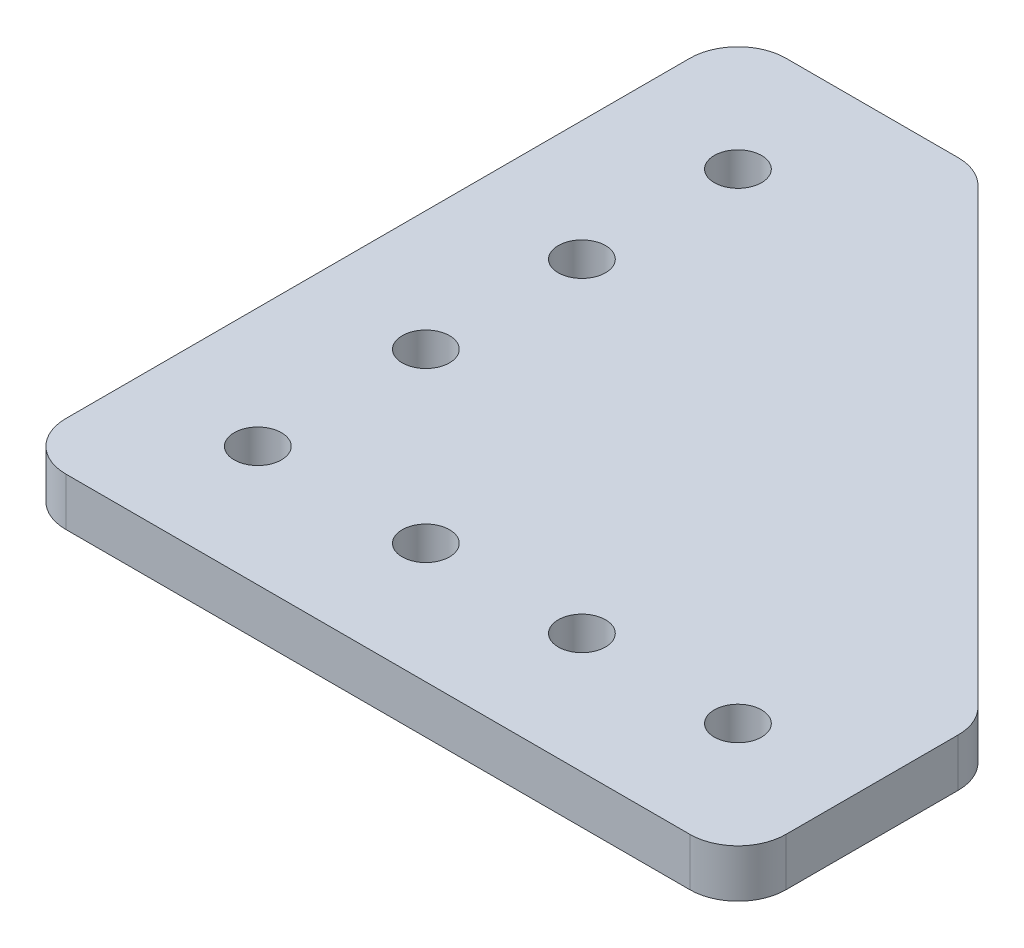
ISO-10303-21;
HEADER;
FILE_DESCRIPTION(('STEP AP214'),'2;1');
FILE_NAME('part.step','',(''),(''),'','','');
FILE_SCHEMA(('AUTOMOTIVE_DESIGN { 1 0 10303 214 1 1 1 1 }'));
ENDSEC;
DATA;
#1=APPLICATION_CONTEXT('core data for automotive mechanical design processes');
#2=APPLICATION_PROTOCOL_DEFINITION('international standard','automotive_design',2000,#1);
#3=PRODUCT_CONTEXT('',#1,'mechanical');
#4=PRODUCT('Part','Part','',(#3));
#5=PRODUCT_RELATED_PRODUCT_CATEGORY('part','',(#4));
#6=PRODUCT_DEFINITION_FORMATION('','',#4);
#7=PRODUCT_DEFINITION_CONTEXT('part definition',#1,'design');
#8=PRODUCT_DEFINITION('design','',#6,#7);
#9=PRODUCT_DEFINITION_SHAPE('','',#8);
#10=(LENGTH_UNIT() NAMED_UNIT(*) SI_UNIT(.MILLI.,.METRE.));
#11=(NAMED_UNIT(*) PLANE_ANGLE_UNIT() SI_UNIT($,.RADIAN.));
#12=(NAMED_UNIT(*) SI_UNIT($,.STERADIAN.) SOLID_ANGLE_UNIT());
#13=UNCERTAINTY_MEASURE_WITH_UNIT(LENGTH_MEASURE(1.E-05),#10,'distance_accuracy_value','');
#14=(GEOMETRIC_REPRESENTATION_CONTEXT(3) GLOBAL_UNCERTAINTY_ASSIGNED_CONTEXT((#13)) GLOBAL_UNIT_ASSIGNED_CONTEXT((#10,
#11,#12)) REPRESENTATION_CONTEXT('',''));
#15=CARTESIAN_POINT('',(0.,0.,0.));
#16=DIRECTION('',(0.,0.,1.));
#17=DIRECTION('',(1.,0.,0.));
#18=AXIS2_PLACEMENT_3D('',#15,#16,#17);
#19=CARTESIAN_POINT('',(0.,5.08,0.));
#20=DIRECTION('',(0.,-1.,0.));
#21=DIRECTION('',(0.,0.,-1.));
#22=AXIS2_PLACEMENT_3D('',#19,#20,#21);
#23=PLANE('',#22);
#24=DIRECTION('',(-0.707106781186548,0.,-0.707106781186548));
#25=VECTOR('',#24,1.);
#26=CARTESIAN_POINT('',(25.4,5.08,-76.2));
#27=LINE('',#26,#25);
#28=CARTESIAN_POINT('',(74.7121024484277,5.08,-26.8878975515723));
#29=VERTEX_POINT('',#28);
#30=CARTESIAN_POINT('',(26.8878975515723,5.08,-74.7121024484277));
#31=VERTEX_POINT('',#30);
#32=EDGE_CURVE('E208',#29,#31,#27,.T.);
#33=ORIENTED_EDGE('',*,*,#32,.T.);
#34=CARTESIAN_POINT('',(23.2957951031447,5.08,-71.12));
#35=DIRECTION('',(0.,-1.,0.));
#36=DIRECTION('',(0.,0.,-1.));
#37=AXIS2_PLACEMENT_3D('',#34,#35,#36);
#38=CIRCLE('',#37,5.08);
#39=CARTESIAN_POINT('',(23.2957951031447,5.08,-76.2));
#40=VERTEX_POINT('',#39);
#41=EDGE_CURVE('E189',#31,#40,#38,.F.);
#42=ORIENTED_EDGE('',*,*,#41,.T.);
#43=DIRECTION('',(-1.,0.,0.));
#44=VECTOR('',#43,1.);
#45=CARTESIAN_POINT('',(0.,5.08,-76.2));
#46=LINE('',#45,#44);
#47=CARTESIAN_POINT('',(5.08,5.08,-76.2));
#48=VERTEX_POINT('',#47);
#49=EDGE_CURVE('E210',#40,#48,#46,.T.);
#50=ORIENTED_EDGE('',*,*,#49,.T.);
#51=CARTESIAN_POINT('',(5.08,5.08,-71.12));
#52=DIRECTION('',(0.,-1.,0.));
#53=DIRECTION('',(0.,0.,-1.));
#54=AXIS2_PLACEMENT_3D('',#51,#52,#53);
#55=CIRCLE('',#54,5.08);
#56=CARTESIAN_POINT('',(0.,5.08,-71.12));
#57=VERTEX_POINT('',#56);
#58=EDGE_CURVE('E187',#48,#57,#55,.F.);
#59=ORIENTED_EDGE('',*,*,#58,.T.);
#60=DIRECTION('',(0.,0.,1.));
#61=VECTOR('',#60,1.);
#62=CARTESIAN_POINT('',(0.,5.08,0.));
#63=LINE('',#62,#61);
#64=CARTESIAN_POINT('',(0.,5.08,-5.08));
#65=VERTEX_POINT('',#64);
#66=EDGE_CURVE('E140',#57,#65,#63,.T.);
#67=ORIENTED_EDGE('',*,*,#66,.T.);
#68=CARTESIAN_POINT('',(5.08,5.08,-5.08));
#69=DIRECTION('',(0.,-1.,0.));
#70=DIRECTION('',(0.,0.,-1.));
#71=AXIS2_PLACEMENT_3D('',#68,#69,#70);
#72=CIRCLE('',#71,5.08);
#73=CARTESIAN_POINT('',(5.08000000000003,5.08,0.));
#74=VERTEX_POINT('',#73);
#75=EDGE_CURVE('E165',#65,#74,#72,.F.);
#76=ORIENTED_EDGE('',*,*,#75,.T.);
#77=DIRECTION('',(1.,0.,0.));
#78=VECTOR('',#77,1.);
#79=CARTESIAN_POINT('',(76.2,5.08,0.));
#80=LINE('',#79,#78);
#81=CARTESIAN_POINT('',(71.12,5.08,0.));
#82=VERTEX_POINT('',#81);
#83=EDGE_CURVE('E139',#74,#82,#80,.T.);
#84=ORIENTED_EDGE('',*,*,#83,.T.);
#85=CARTESIAN_POINT('',(71.12,5.08,-5.08));
#86=DIRECTION('',(0.,-1.,0.));
#87=DIRECTION('',(0.,0.,-1.));
#88=AXIS2_PLACEMENT_3D('',#85,#86,#87);
#89=CIRCLE('',#88,5.08);
#90=CARTESIAN_POINT('',(76.2,5.08,-5.08));
#91=VERTEX_POINT('',#90);
#92=EDGE_CURVE('E65',#82,#91,#89,.F.);
#93=ORIENTED_EDGE('',*,*,#92,.T.);
#94=DIRECTION('',(0.,0.,-1.));
#95=VECTOR('',#94,1.);
#96=CARTESIAN_POINT('',(76.2,5.08,-25.4));
#97=LINE('',#96,#95);
#98=CARTESIAN_POINT('',(76.2,5.08,-23.2957951031447));
#99=VERTEX_POINT('',#98);
#100=EDGE_CURVE('E197',#91,#99,#97,.T.);
#101=ORIENTED_EDGE('',*,*,#100,.T.);
#102=CARTESIAN_POINT('',(71.12,5.08,-23.2957951031447));
#103=DIRECTION('',(0.,-1.,0.));
#104=DIRECTION('',(0.,0.,-1.));
#105=AXIS2_PLACEMENT_3D('',#102,#103,#104);
#106=CIRCLE('',#105,5.08);
#107=EDGE_CURVE('E184',#99,#29,#106,.F.);
#108=ORIENTED_EDGE('',*,*,#107,.T.);
#109=EDGE_LOOP('',(#33,#42,#50,#59,#67,#76,#84,#93,#101,#108));
#110=FACE_BOUND('',#109,.T.);
#111=CARTESIAN_POINT('',(12.7,5.08,-63.5));
#112=DIRECTION('',(0.,1.,0.));
#113=DIRECTION('',(0.,0.,1.));
#114=AXIS2_PLACEMENT_3D('',#111,#112,#113);
#115=CIRCLE('',#114,2.5);
#116=CARTESIAN_POINT('',(12.7,5.08,-61.));
#117=VERTEX_POINT('',#116);
#118=EDGE_CURVE('E148',#117,#117,#115,.T.);
#119=ORIENTED_EDGE('',*,*,#118,.F.);
#120=EDGE_LOOP('',(#119));
#121=FACE_BOUND('',#120,.T.);
#122=CARTESIAN_POINT('',(63.5,5.08,-12.7));
#123=DIRECTION('',(0.,1.,0.));
#124=DIRECTION('',(0.,0.,1.));
#125=AXIS2_PLACEMENT_3D('',#122,#123,#124);
#126=CIRCLE('',#125,2.5);
#127=CARTESIAN_POINT('',(63.5,5.08,-10.2));
#128=VERTEX_POINT('',#127);
#129=EDGE_CURVE('E218',#128,#128,#126,.T.);
#130=ORIENTED_EDGE('',*,*,#129,.F.);
#131=EDGE_LOOP('',(#130));
#132=FACE_BOUND('',#131,.T.);
#133=CARTESIAN_POINT('',(12.7000000000002,5.08,-46.99));
#134=DIRECTION('',(0.,1.,0.));
#135=DIRECTION('',(0.,0.,1.));
#136=AXIS2_PLACEMENT_3D('',#133,#134,#135);
#137=CIRCLE('',#136,2.5);
#138=CARTESIAN_POINT('',(12.7000000000002,5.08,-44.49));
#139=VERTEX_POINT('',#138);
#140=EDGE_CURVE('E223',#139,#139,#137,.T.);
#141=ORIENTED_EDGE('',*,*,#140,.F.);
#142=EDGE_LOOP('',(#141));
#143=FACE_BOUND('',#142,.T.);
#144=CARTESIAN_POINT('',(12.7000000000005,5.08,-30.48));
#145=DIRECTION('',(0.,1.,0.));
#146=DIRECTION('',(0.,0.,1.));
#147=AXIS2_PLACEMENT_3D('',#144,#145,#146);
#148=CIRCLE('',#147,2.5);
#149=CARTESIAN_POINT('',(12.7000000000005,5.08,-27.98));
#150=VERTEX_POINT('',#149);
#151=EDGE_CURVE('E229',#150,#150,#148,.T.);
#152=ORIENTED_EDGE('',*,*,#151,.F.);
#153=EDGE_LOOP('',(#152));
#154=FACE_BOUND('',#153,.T.);
#155=CARTESIAN_POINT('',(12.7,5.08,-12.7));
#156=DIRECTION('',(0.,1.,0.));
#157=DIRECTION('',(0.,0.,1.));
#158=AXIS2_PLACEMENT_3D('',#155,#156,#157);
#159=CIRCLE('',#158,2.5);
#160=CARTESIAN_POINT('',(12.7,5.08,-10.2));
#161=VERTEX_POINT('',#160);
#162=EDGE_CURVE('E235',#161,#161,#159,.T.);
#163=ORIENTED_EDGE('',*,*,#162,.F.);
#164=EDGE_LOOP('',(#163));
#165=FACE_BOUND('',#164,.T.);
#166=CARTESIAN_POINT('',(46.99,5.08,-12.7));
#167=DIRECTION('',(0.,1.,0.));
#168=DIRECTION('',(0.,0.,1.));
#169=AXIS2_PLACEMENT_3D('',#166,#167,#168);
#170=CIRCLE('',#169,2.5);
#171=CARTESIAN_POINT('',(46.99,5.08,-10.2));
#172=VERTEX_POINT('',#171);
#173=EDGE_CURVE('E241',#172,#172,#170,.T.);
#174=ORIENTED_EDGE('',*,*,#173,.F.);
#175=EDGE_LOOP('',(#174));
#176=FACE_BOUND('',#175,.T.);
#177=CARTESIAN_POINT('',(30.48,5.08,-12.7));
#178=DIRECTION('',(0.,1.,0.));
#179=DIRECTION('',(0.,0.,1.));
#180=AXIS2_PLACEMENT_3D('',#177,#178,#179);
#181=CIRCLE('',#180,2.5);
#182=CARTESIAN_POINT('',(30.48,5.08,-10.2));
#183=VERTEX_POINT('',#182);
#184=EDGE_CURVE('E247',#183,#183,#181,.T.);
#185=ORIENTED_EDGE('',*,*,#184,.F.);
#186=EDGE_LOOP('',(#185));
#187=FACE_BOUND('',#186,.T.);
#188=ADVANCED_FACE('F43',(#110,#121,#132,#143,#154,#165,#176,#187),#23,.F.);
#189=CARTESIAN_POINT('',(0.,0.,0.));
#190=DIRECTION('',(0.,-1.,0.));
#191=DIRECTION('',(0.,0.,-1.));
#192=AXIS2_PLACEMENT_3D('',#189,#190,#191);
#193=PLANE('',#192);
#194=CARTESIAN_POINT('',(46.99,0.,-12.7));
#195=DIRECTION('',(0.,1.,0.));
#196=DIRECTION('',(0.,0.,1.));
#197=AXIS2_PLACEMENT_3D('',#194,#195,#196);
#198=CIRCLE('',#197,2.5);
#199=CARTESIAN_POINT('',(46.99,0.,-10.2));
#200=VERTEX_POINT('',#199);
#201=EDGE_CURVE('E244',#200,#200,#198,.T.);
#202=ORIENTED_EDGE('',*,*,#201,.T.);
#203=EDGE_LOOP('',(#202));
#204=FACE_BOUND('',#203,.T.);
#205=CARTESIAN_POINT('',(12.7000000000005,0.,-30.48));
#206=DIRECTION('',(0.,1.,0.));
#207=DIRECTION('',(0.,0.,1.));
#208=AXIS2_PLACEMENT_3D('',#205,#206,#207);
#209=CIRCLE('',#208,2.5);
#210=CARTESIAN_POINT('',(12.7000000000005,0.,-27.98));
#211=VERTEX_POINT('',#210);
#212=EDGE_CURVE('E232',#211,#211,#209,.T.);
#213=ORIENTED_EDGE('',*,*,#212,.T.);
#214=EDGE_LOOP('',(#213));
#215=FACE_BOUND('',#214,.T.);
#216=CARTESIAN_POINT('',(63.5,0.,-12.7));
#217=DIRECTION('',(0.,1.,0.));
#218=DIRECTION('',(0.,0.,1.));
#219=AXIS2_PLACEMENT_3D('',#216,#217,#218);
#220=CIRCLE('',#219,2.5);
#221=CARTESIAN_POINT('',(63.5,0.,-10.2));
#222=VERTEX_POINT('',#221);
#223=EDGE_CURVE('E220',#222,#222,#220,.T.);
#224=ORIENTED_EDGE('',*,*,#223,.T.);
#225=EDGE_LOOP('',(#224));
#226=FACE_BOUND('',#225,.T.);
#227=DIRECTION('',(-1.,0.,0.));
#228=VECTOR('',#227,1.);
#229=CARTESIAN_POINT('',(0.,0.,-76.2));
#230=LINE('',#229,#228);
#231=CARTESIAN_POINT('',(23.2957951031447,0.,-76.2));
#232=VERTEX_POINT('',#231);
#233=CARTESIAN_POINT('',(5.08,0.,-76.2));
#234=VERTEX_POINT('',#233);
#235=EDGE_CURVE('E159',#232,#234,#230,.T.);
#236=ORIENTED_EDGE('',*,*,#235,.F.);
#237=CARTESIAN_POINT('',(23.2957951031447,0.,-71.12));
#238=DIRECTION('',(0.,-1.,0.));
#239=DIRECTION('',(0.,0.,-1.));
#240=AXIS2_PLACEMENT_3D('',#237,#238,#239);
#241=CIRCLE('',#240,5.08);
#242=CARTESIAN_POINT('',(26.8878975515723,0.,-74.7121024484277));
#243=VERTEX_POINT('',#242);
#244=EDGE_CURVE('E177',#232,#243,#241,.T.);
#245=ORIENTED_EDGE('',*,*,#244,.T.);
#246=DIRECTION('',(-0.707106781186548,0.,-0.707106781186548));
#247=VECTOR('',#246,1.);
#248=CARTESIAN_POINT('',(25.4,0.,-76.2));
#249=LINE('',#248,#247);
#250=CARTESIAN_POINT('',(74.7121024484277,0.,-26.8878975515723));
#251=VERTEX_POINT('',#250);
#252=EDGE_CURVE('E150',#251,#243,#249,.T.);
#253=ORIENTED_EDGE('',*,*,#252,.F.);
#254=CARTESIAN_POINT('',(71.12,0.,-23.2957951031447));
#255=DIRECTION('',(0.,-1.,0.));
#256=DIRECTION('',(0.,0.,-1.));
#257=AXIS2_PLACEMENT_3D('',#254,#255,#256);
#258=CIRCLE('',#257,5.08);
#259=CARTESIAN_POINT('',(76.2,0.,-23.2957951031447));
#260=VERTEX_POINT('',#259);
#261=EDGE_CURVE('E172',#251,#260,#258,.T.);
#262=ORIENTED_EDGE('',*,*,#261,.T.);
#263=DIRECTION('',(0.,0.,-1.));
#264=VECTOR('',#263,1.);
#265=CARTESIAN_POINT('',(76.2,0.,-25.4));
#266=LINE('',#265,#264);
#267=CARTESIAN_POINT('',(76.2,0.,-5.08));
#268=VERTEX_POINT('',#267);
#269=EDGE_CURVE('E147',#268,#260,#266,.T.);
#270=ORIENTED_EDGE('',*,*,#269,.F.);
#271=CARTESIAN_POINT('',(71.12,0.,-5.08));
#272=DIRECTION('',(0.,-1.,0.));
#273=DIRECTION('',(0.,0.,-1.));
#274=AXIS2_PLACEMENT_3D('',#271,#272,#273);
#275=CIRCLE('',#274,5.08);
#276=CARTESIAN_POINT('',(71.12,0.,0.));
#277=VERTEX_POINT('',#276);
#278=EDGE_CURVE('E146',#268,#277,#275,.T.);
#279=ORIENTED_EDGE('',*,*,#278,.T.);
#280=DIRECTION('',(1.,0.,0.));
#281=VECTOR('',#280,1.);
#282=CARTESIAN_POINT('',(76.2,0.,0.));
#283=LINE('',#282,#281);
#284=CARTESIAN_POINT('',(5.08000000000003,0.,0.));
#285=VERTEX_POINT('',#284);
#286=EDGE_CURVE('E137',#285,#277,#283,.T.);
#287=ORIENTED_EDGE('',*,*,#286,.F.);
#288=CARTESIAN_POINT('',(5.08,0.,-5.08));
#289=DIRECTION('',(0.,-1.,0.));
#290=DIRECTION('',(0.,0.,-1.));
#291=AXIS2_PLACEMENT_3D('',#288,#289,#290);
#292=CIRCLE('',#291,5.08);
#293=CARTESIAN_POINT('',(0.,0.,-5.08));
#294=VERTEX_POINT('',#293);
#295=EDGE_CURVE('E122',#285,#294,#292,.T.);
#296=ORIENTED_EDGE('',*,*,#295,.T.);
#297=DIRECTION('',(0.,0.,1.));
#298=VECTOR('',#297,1.);
#299=CARTESIAN_POINT('',(0.,0.,0.));
#300=LINE('',#299,#298);
#301=CARTESIAN_POINT('',(0.,0.,-71.12));
#302=VERTEX_POINT('',#301);
#303=EDGE_CURVE('E162',#302,#294,#300,.T.);
#304=ORIENTED_EDGE('',*,*,#303,.F.);
#305=CARTESIAN_POINT('',(5.08,0.,-71.12));
#306=DIRECTION('',(0.,-1.,0.));
#307=DIRECTION('',(0.,0.,-1.));
#308=AXIS2_PLACEMENT_3D('',#305,#306,#307);
#309=CIRCLE('',#308,5.08);
#310=EDGE_CURVE('E175',#302,#234,#309,.T.);
#311=ORIENTED_EDGE('',*,*,#310,.T.);
#312=EDGE_LOOP('',(#236,#245,#253,#262,#270,#279,#287,#296,#304,#311));
#313=FACE_BOUND('',#312,.T.);
#314=CARTESIAN_POINT('',(12.7,0.,-63.5));
#315=DIRECTION('',(0.,1.,0.));
#316=DIRECTION('',(0.,0.,1.));
#317=AXIS2_PLACEMENT_3D('',#314,#315,#316);
#318=CIRCLE('',#317,2.5);
#319=CARTESIAN_POINT('',(12.7,0.,-61.));
#320=VERTEX_POINT('',#319);
#321=EDGE_CURVE('E153',#320,#320,#318,.T.);
#322=ORIENTED_EDGE('',*,*,#321,.T.);
#323=EDGE_LOOP('',(#322));
#324=FACE_BOUND('',#323,.T.);
#325=CARTESIAN_POINT('',(12.7000000000002,0.,-46.99));
#326=DIRECTION('',(0.,1.,0.));
#327=DIRECTION('',(0.,0.,1.));
#328=AXIS2_PLACEMENT_3D('',#325,#326,#327);
#329=CIRCLE('',#328,2.5);
#330=CARTESIAN_POINT('',(12.7000000000002,0.,-44.49));
#331=VERTEX_POINT('',#330);
#332=EDGE_CURVE('E226',#331,#331,#329,.T.);
#333=ORIENTED_EDGE('',*,*,#332,.T.);
#334=EDGE_LOOP('',(#333));
#335=FACE_BOUND('',#334,.T.);
#336=CARTESIAN_POINT('',(12.7,0.,-12.7));
#337=DIRECTION('',(0.,1.,0.));
#338=DIRECTION('',(0.,0.,1.));
#339=AXIS2_PLACEMENT_3D('',#336,#337,#338);
#340=CIRCLE('',#339,2.5);
#341=CARTESIAN_POINT('',(12.7,0.,-10.2));
#342=VERTEX_POINT('',#341);
#343=EDGE_CURVE('E238',#342,#342,#340,.T.);
#344=ORIENTED_EDGE('',*,*,#343,.T.);
#345=EDGE_LOOP('',(#344));
#346=FACE_BOUND('',#345,.T.);
#347=CARTESIAN_POINT('',(30.48,0.,-12.7));
#348=DIRECTION('',(0.,1.,0.));
#349=DIRECTION('',(0.,0.,1.));
#350=AXIS2_PLACEMENT_3D('',#347,#348,#349);
#351=CIRCLE('',#350,2.5);
#352=CARTESIAN_POINT('',(30.48,0.,-10.2));
#353=VERTEX_POINT('',#352);
#354=EDGE_CURVE('E250',#353,#353,#351,.T.);
#355=ORIENTED_EDGE('',*,*,#354,.T.);
#356=EDGE_LOOP('',(#355));
#357=FACE_BOUND('',#356,.T.);
#358=ADVANCED_FACE('F143',(#204,#215,#226,#313,#324,#335,#346,#357),#193,.T.);
#359=CARTESIAN_POINT('',(76.2,5.08,0.));
#360=DIRECTION('',(0.,0.,-1.));
#361=DIRECTION('',(-1.,0.,0.));
#362=AXIS2_PLACEMENT_3D('',#359,#360,#361);
#363=PLANE('',#362);
#364=ORIENTED_EDGE('',*,*,#286,.T.);
#365=DIRECTION('',(0.,-1.,0.));
#366=VECTOR('',#365,1.);
#367=CARTESIAN_POINT('',(71.12,5.08,0.));
#368=LINE('',#367,#366);
#369=EDGE_CURVE('E12',#277,#82,#368,.F.);
#370=ORIENTED_EDGE('',*,*,#369,.T.);
#371=ORIENTED_EDGE('',*,*,#83,.F.);
#372=DIRECTION('',(0.,-1.,0.));
#373=VECTOR('',#372,1.);
#374=CARTESIAN_POINT('',(5.08,5.08,0.));
#375=LINE('',#374,#373);
#376=EDGE_CURVE('E126',#74,#285,#375,.T.);
#377=ORIENTED_EDGE('',*,*,#376,.T.);
#378=EDGE_LOOP('',(#364,#370,#371,#377));
#379=FACE_BOUND('',#378,.T.);
#380=ADVANCED_FACE('F136',(#379),#363,.F.);
#381=CARTESIAN_POINT('',(76.2,5.08,-25.4));
#382=DIRECTION('',(-1.,0.,0.));
#383=DIRECTION('',(0.,0.,1.));
#384=AXIS2_PLACEMENT_3D('',#381,#382,#383);
#385=PLANE('',#384);
#386=ORIENTED_EDGE('',*,*,#100,.F.);
#387=DIRECTION('',(0.,-1.,0.));
#388=VECTOR('',#387,1.);
#389=CARTESIAN_POINT('',(76.2,5.08,-5.08));
#390=LINE('',#389,#388);
#391=EDGE_CURVE('E51',#91,#268,#390,.T.);
#392=ORIENTED_EDGE('',*,*,#391,.T.);
#393=ORIENTED_EDGE('',*,*,#269,.T.);
#394=DIRECTION('',(0.,-1.,0.));
#395=VECTOR('',#394,1.);
#396=CARTESIAN_POINT('',(76.2,5.08,-23.2957951031447));
#397=LINE('',#396,#395);
#398=EDGE_CURVE('E58',#260,#99,#397,.F.);
#399=ORIENTED_EDGE('',*,*,#398,.T.);
#400=EDGE_LOOP('',(#386,#392,#393,#399));
#401=FACE_BOUND('',#400,.T.);
#402=ADVANCED_FACE('F196',(#401),#385,.F.);
#403=CARTESIAN_POINT('',(25.4,5.08,-76.2));
#404=DIRECTION('',(-0.707106781186548,0.,0.707106781186548));
#405=DIRECTION('',(0.707106781186548,0.,0.707106781186548));
#406=AXIS2_PLACEMENT_3D('',#403,#404,#405);
#407=PLANE('',#406);
#408=ORIENTED_EDGE('',*,*,#252,.T.);
#409=DIRECTION('',(0.,-1.,0.));
#410=VECTOR('',#409,1.);
#411=CARTESIAN_POINT('',(26.8878975515723,5.08,-74.7121024484277));
#412=LINE('',#411,#410);
#413=EDGE_CURVE('E182',#243,#31,#412,.F.);
#414=ORIENTED_EDGE('',*,*,#413,.T.);
#415=ORIENTED_EDGE('',*,*,#32,.F.);
#416=DIRECTION('',(0.,-1.,0.));
#417=VECTOR('',#416,1.);
#418=CARTESIAN_POINT('',(74.7121024484277,5.08,-26.8878975515723));
#419=LINE('',#418,#417);
#420=EDGE_CURVE('E179',#29,#251,#419,.T.);
#421=ORIENTED_EDGE('',*,*,#420,.T.);
#422=EDGE_LOOP('',(#408,#414,#415,#421));
#423=FACE_BOUND('',#422,.T.);
#424=ADVANCED_FACE('F205',(#423),#407,.F.);
#425=CARTESIAN_POINT('',(0.,5.08,-76.2));
#426=DIRECTION('',(0.,0.,1.));
#427=DIRECTION('',(1.,0.,0.));
#428=AXIS2_PLACEMENT_3D('',#425,#426,#427);
#429=PLANE('',#428);
#430=ORIENTED_EDGE('',*,*,#49,.F.);
#431=DIRECTION('',(0.,-1.,0.));
#432=VECTOR('',#431,1.);
#433=CARTESIAN_POINT('',(23.2957951031447,5.08,-76.2));
#434=LINE('',#433,#432);
#435=EDGE_CURVE('E169',#40,#232,#434,.T.);
#436=ORIENTED_EDGE('',*,*,#435,.T.);
#437=ORIENTED_EDGE('',*,*,#235,.T.);
#438=DIRECTION('',(0.,-1.,0.));
#439=VECTOR('',#438,1.);
#440=CARTESIAN_POINT('',(5.08,5.08,-76.2));
#441=LINE('',#440,#439);
#442=EDGE_CURVE('E167',#234,#48,#441,.F.);
#443=ORIENTED_EDGE('',*,*,#442,.T.);
#444=EDGE_LOOP('',(#430,#436,#437,#443));
#445=FACE_BOUND('',#444,.T.);
#446=ADVANCED_FACE('F274',(#445),#429,.F.);
#447=CARTESIAN_POINT('',(0.,5.08,0.));
#448=DIRECTION('',(1.,0.,0.));
#449=DIRECTION('',(0.,0.,-1.));
#450=AXIS2_PLACEMENT_3D('',#447,#448,#449);
#451=PLANE('',#450);
#452=ORIENTED_EDGE('',*,*,#66,.F.);
#453=DIRECTION('',(0.,-1.,0.));
#454=VECTOR('',#453,1.);
#455=CARTESIAN_POINT('',(0.,5.08,-71.12));
#456=LINE('',#455,#454);
#457=EDGE_CURVE('E191',#57,#302,#456,.T.);
#458=ORIENTED_EDGE('',*,*,#457,.T.);
#459=ORIENTED_EDGE('',*,*,#303,.T.);
#460=DIRECTION('',(0.,-1.,0.));
#461=VECTOR('',#460,1.);
#462=CARTESIAN_POINT('',(0.,5.08,-5.08));
#463=LINE('',#462,#461);
#464=EDGE_CURVE('E128',#294,#65,#463,.F.);
#465=ORIENTED_EDGE('',*,*,#464,.T.);
#466=EDGE_LOOP('',(#452,#458,#459,#465));
#467=FACE_BOUND('',#466,.T.);
#468=ADVANCED_FACE('F271',(#467),#451,.F.);
#469=CARTESIAN_POINT('',(12.7,5.08,-63.5));
#470=DIRECTION('',(0.,-1.,0.));
#471=DIRECTION('',(0.,0.,-1.));
#472=AXIS2_PLACEMENT_3D('',#469,#470,#471);
#473=CYLINDRICAL_SURFACE('',#472,2.5);
#474=ORIENTED_EDGE('',*,*,#118,.T.);
#475=EDGE_LOOP('',(#474));
#476=FACE_BOUND('',#475,.T.);
#477=ORIENTED_EDGE('',*,*,#321,.F.);
#478=EDGE_LOOP('',(#477));
#479=FACE_BOUND('',#478,.T.);
#480=ADVANCED_FACE('F268',(#476,#479),#473,.F.);
#481=CARTESIAN_POINT('',(63.5,5.08,-12.7));
#482=DIRECTION('',(0.,-1.,0.));
#483=DIRECTION('',(0.,0.,-1.));
#484=AXIS2_PLACEMENT_3D('',#481,#482,#483);
#485=CYLINDRICAL_SURFACE('',#484,2.5);
#486=ORIENTED_EDGE('',*,*,#129,.T.);
#487=EDGE_LOOP('',(#486));
#488=FACE_BOUND('',#487,.T.);
#489=ORIENTED_EDGE('',*,*,#223,.F.);
#490=EDGE_LOOP('',(#489));
#491=FACE_BOUND('',#490,.T.);
#492=ADVANCED_FACE('F419',(#488,#491),#485,.F.);
#493=CARTESIAN_POINT('',(12.7000000000002,5.08,-46.99));
#494=DIRECTION('',(0.,-1.,0.));
#495=DIRECTION('',(0.,0.,-1.));
#496=AXIS2_PLACEMENT_3D('',#493,#494,#495);
#497=CYLINDRICAL_SURFACE('',#496,2.5);
#498=ORIENTED_EDGE('',*,*,#140,.T.);
#499=EDGE_LOOP('',(#498));
#500=FACE_BOUND('',#499,.T.);
#501=ORIENTED_EDGE('',*,*,#332,.F.);
#502=EDGE_LOOP('',(#501));
#503=FACE_BOUND('',#502,.T.);
#504=ADVANCED_FACE('F409',(#500,#503),#497,.F.);
#505=CARTESIAN_POINT('',(12.7000000000005,5.08,-30.48));
#506=DIRECTION('',(0.,-1.,0.));
#507=DIRECTION('',(0.,0.,-1.));
#508=AXIS2_PLACEMENT_3D('',#505,#506,#507);
#509=CYLINDRICAL_SURFACE('',#508,2.5);
#510=ORIENTED_EDGE('',*,*,#151,.T.);
#511=EDGE_LOOP('',(#510));
#512=FACE_BOUND('',#511,.T.);
#513=ORIENTED_EDGE('',*,*,#212,.F.);
#514=EDGE_LOOP('',(#513));
#515=FACE_BOUND('',#514,.T.);
#516=ADVANCED_FACE('F399',(#512,#515),#509,.F.);
#517=CARTESIAN_POINT('',(12.7,5.08,-12.7));
#518=DIRECTION('',(0.,-1.,0.));
#519=DIRECTION('',(0.,0.,-1.));
#520=AXIS2_PLACEMENT_3D('',#517,#518,#519);
#521=CYLINDRICAL_SURFACE('',#520,2.5);
#522=ORIENTED_EDGE('',*,*,#162,.T.);
#523=EDGE_LOOP('',(#522));
#524=FACE_BOUND('',#523,.T.);
#525=ORIENTED_EDGE('',*,*,#343,.F.);
#526=EDGE_LOOP('',(#525));
#527=FACE_BOUND('',#526,.T.);
#528=ADVANCED_FACE('F389',(#524,#527),#521,.F.);
#529=CARTESIAN_POINT('',(46.99,5.08,-12.7));
#530=DIRECTION('',(0.,-1.,0.));
#531=DIRECTION('',(0.,0.,-1.));
#532=AXIS2_PLACEMENT_3D('',#529,#530,#531);
#533=CYLINDRICAL_SURFACE('',#532,2.5);
#534=ORIENTED_EDGE('',*,*,#173,.T.);
#535=EDGE_LOOP('',(#534));
#536=FACE_BOUND('',#535,.T.);
#537=ORIENTED_EDGE('',*,*,#201,.F.);
#538=EDGE_LOOP('',(#537));
#539=FACE_BOUND('',#538,.T.);
#540=ADVANCED_FACE('F380',(#536,#539),#533,.F.);
#541=CARTESIAN_POINT('',(30.48,5.08,-12.7));
#542=DIRECTION('',(0.,-1.,0.));
#543=DIRECTION('',(0.,0.,-1.));
#544=AXIS2_PLACEMENT_3D('',#541,#542,#543);
#545=CYLINDRICAL_SURFACE('',#544,2.5);
#546=ORIENTED_EDGE('',*,*,#184,.T.);
#547=EDGE_LOOP('',(#546));
#548=FACE_BOUND('',#547,.T.);
#549=ORIENTED_EDGE('',*,*,#354,.F.);
#550=EDGE_LOOP('',(#549));
#551=FACE_BOUND('',#550,.T.);
#552=ADVANCED_FACE('F256',(#548,#551),#545,.F.);
#553=CARTESIAN_POINT('',(5.08,5.08,-5.08));
#554=DIRECTION('',(0.,-1.,0.));
#555=DIRECTION('',(0.,0.,-1.));
#556=AXIS2_PLACEMENT_3D('',#553,#554,#555);
#557=CYLINDRICAL_SURFACE('',#556,5.08);
#558=ORIENTED_EDGE('',*,*,#75,.F.);
#559=ORIENTED_EDGE('',*,*,#464,.F.);
#560=ORIENTED_EDGE('',*,*,#295,.F.);
#561=ORIENTED_EDGE('',*,*,#376,.F.);
#562=EDGE_LOOP('',(#558,#559,#560,#561));
#563=FACE_BOUND('',#562,.T.);
#564=ADVANCED_FACE('F125',(#563),#557,.T.);
#565=CARTESIAN_POINT('',(23.2957951031447,5.08,-71.12));
#566=DIRECTION('',(0.,-1.,0.));
#567=DIRECTION('',(0.,0.,-1.));
#568=AXIS2_PLACEMENT_3D('',#565,#566,#567);
#569=CYLINDRICAL_SURFACE('',#568,5.08);
#570=ORIENTED_EDGE('',*,*,#41,.F.);
#571=ORIENTED_EDGE('',*,*,#413,.F.);
#572=ORIENTED_EDGE('',*,*,#244,.F.);
#573=ORIENTED_EDGE('',*,*,#435,.F.);
#574=EDGE_LOOP('',(#570,#571,#572,#573));
#575=FACE_BOUND('',#574,.T.);
#576=ADVANCED_FACE('F287',(#575),#569,.T.);
#577=CARTESIAN_POINT('',(5.08,5.08,-71.12));
#578=DIRECTION('',(0.,-1.,0.));
#579=DIRECTION('',(0.,0.,-1.));
#580=AXIS2_PLACEMENT_3D('',#577,#578,#579);
#581=CYLINDRICAL_SURFACE('',#580,5.08);
#582=ORIENTED_EDGE('',*,*,#58,.F.);
#583=ORIENTED_EDGE('',*,*,#442,.F.);
#584=ORIENTED_EDGE('',*,*,#310,.F.);
#585=ORIENTED_EDGE('',*,*,#457,.F.);
#586=EDGE_LOOP('',(#582,#583,#584,#585));
#587=FACE_BOUND('',#586,.T.);
#588=ADVANCED_FACE('F290',(#587),#581,.T.);
#589=CARTESIAN_POINT('',(71.12,5.08,-5.08));
#590=DIRECTION('',(0.,-1.,0.));
#591=DIRECTION('',(0.,0.,-1.));
#592=AXIS2_PLACEMENT_3D('',#589,#590,#591);
#593=CYLINDRICAL_SURFACE('',#592,5.08);
#594=ORIENTED_EDGE('',*,*,#92,.F.);
#595=ORIENTED_EDGE('',*,*,#369,.F.);
#596=ORIENTED_EDGE('',*,*,#278,.F.);
#597=ORIENTED_EDGE('',*,*,#391,.F.);
#598=EDGE_LOOP('',(#594,#595,#596,#597));
#599=FACE_BOUND('',#598,.T.);
#600=ADVANCED_FACE('F293',(#599),#593,.T.);
#601=CARTESIAN_POINT('',(71.12,5.08,-23.2957951031447));
#602=DIRECTION('',(0.,-1.,0.));
#603=DIRECTION('',(0.,0.,-1.));
#604=AXIS2_PLACEMENT_3D('',#601,#602,#603);
#605=CYLINDRICAL_SURFACE('',#604,5.08);
#606=ORIENTED_EDGE('',*,*,#107,.F.);
#607=ORIENTED_EDGE('',*,*,#398,.F.);
#608=ORIENTED_EDGE('',*,*,#261,.F.);
#609=ORIENTED_EDGE('',*,*,#420,.F.);
#610=EDGE_LOOP('',(#606,#607,#608,#609));
#611=FACE_BOUND('',#610,.T.);
#612=ADVANCED_FACE('F45',(#611),#605,.T.);
#613=CLOSED_SHELL('',(#188,#358,#380,#402,#424,#446,#468,#480,#492,#504,#516,#528,#540,#552,
#564,#576,#588,#600,#612));
#614=MANIFOLD_SOLID_BREP('B2',#613);
#615=ADVANCED_BREP_SHAPE_REPRESENTATION('',(#18,#614),#14);
#616=SHAPE_DEFINITION_REPRESENTATION(#9,#615);
ENDSEC;
END-ISO-10303-21;
